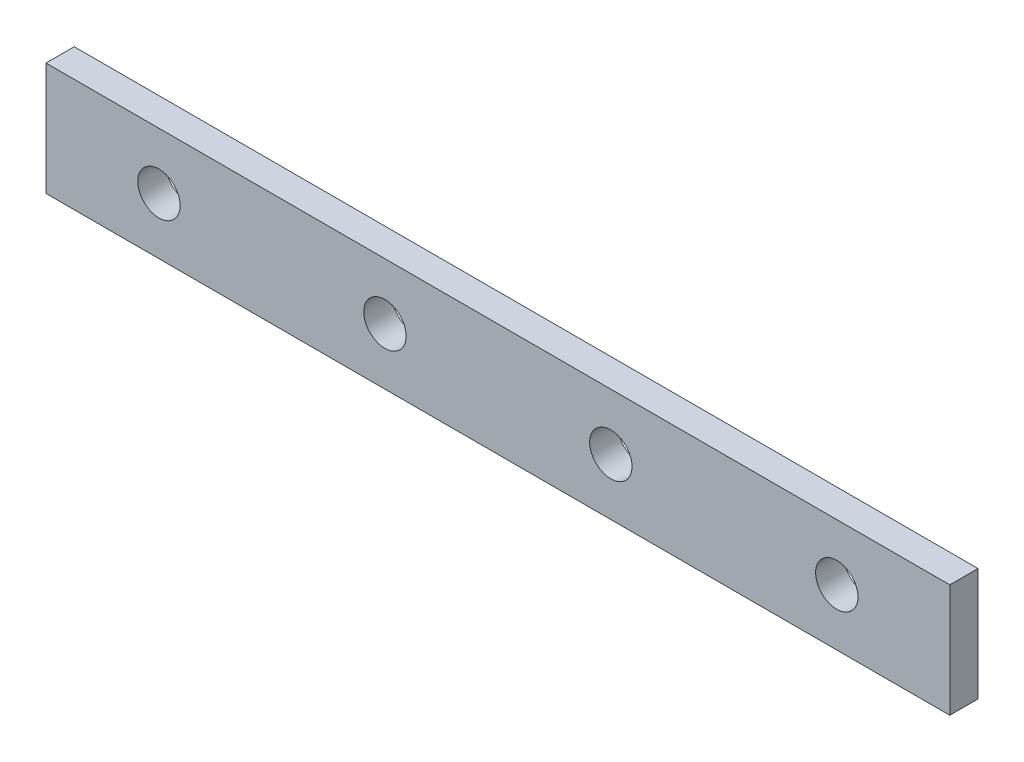
ISO-10303-21;
HEADER;
FILE_DESCRIPTION(('STEP AP214'),'2;1');
FILE_NAME('part.step','',(''),(''),'','','');
FILE_SCHEMA(('AUTOMOTIVE_DESIGN { 1 0 10303 214 1 1 1 1 }'));
ENDSEC;
DATA;
#1=APPLICATION_CONTEXT('core data for automotive mechanical design processes');
#2=APPLICATION_PROTOCOL_DEFINITION('international standard','automotive_design',2000,#1);
#3=PRODUCT_CONTEXT('',#1,'mechanical');
#4=PRODUCT('Part','Part','',(#3));
#5=PRODUCT_RELATED_PRODUCT_CATEGORY('part','',(#4));
#6=PRODUCT_DEFINITION_FORMATION('','',#4);
#7=PRODUCT_DEFINITION_CONTEXT('part definition',#1,'design');
#8=PRODUCT_DEFINITION('design','',#6,#7);
#9=PRODUCT_DEFINITION_SHAPE('','',#8);
#10=(LENGTH_UNIT() NAMED_UNIT(*) SI_UNIT(.MILLI.,.METRE.));
#11=(NAMED_UNIT(*) PLANE_ANGLE_UNIT() SI_UNIT($,.RADIAN.));
#12=(NAMED_UNIT(*) SI_UNIT($,.STERADIAN.) SOLID_ANGLE_UNIT());
#13=UNCERTAINTY_MEASURE_WITH_UNIT(LENGTH_MEASURE(1.E-05),#10,'distance_accuracy_value','');
#14=(GEOMETRIC_REPRESENTATION_CONTEXT(3) GLOBAL_UNCERTAINTY_ASSIGNED_CONTEXT((#13)) GLOBAL_UNIT_ASSIGNED_CONTEXT((#10,
#11,#12)) REPRESENTATION_CONTEXT('',''));
#15=CARTESIAN_POINT('',(0.,0.,0.));
#16=DIRECTION('',(0.,0.,1.));
#17=DIRECTION('',(1.,0.,0.));
#18=AXIS2_PLACEMENT_3D('',#15,#16,#17);
#19=CARTESIAN_POINT('',(76.2,0.,0.));
#20=DIRECTION('',(0.,0.,1.));
#21=DIRECTION('',(1.,0.,0.));
#22=AXIS2_PLACEMENT_3D('',#19,#20,#21);
#23=CYLINDRICAL_SURFACE('',#22,4.7625);
#24=CARTESIAN_POINT('',(76.2,0.,0.));
#25=DIRECTION('',(0.,0.,1.));
#26=DIRECTION('',(1.,0.,0.));
#27=AXIS2_PLACEMENT_3D('',#24,#25,#26);
#28=CIRCLE('',#27,4.7625);
#29=CARTESIAN_POINT('',(80.9625,0.,0.));
#30=VERTEX_POINT('',#29);
#31=EDGE_CURVE('E41',#30,#30,#28,.T.);
#32=ORIENTED_EDGE('',*,*,#31,.F.);
#33=EDGE_LOOP('',(#32));
#34=FACE_BOUND('',#33,.T.);
#35=CARTESIAN_POINT('',(76.2,0.,6.35));
#36=DIRECTION('',(0.,0.,1.));
#37=DIRECTION('',(1.,0.,0.));
#38=AXIS2_PLACEMENT_3D('',#35,#36,#37);
#39=CIRCLE('',#38,4.7625);
#40=CARTESIAN_POINT('',(80.9625,0.,6.35));
#41=VERTEX_POINT('',#40);
#42=EDGE_CURVE('E11',#41,#41,#39,.T.);
#43=ORIENTED_EDGE('',*,*,#42,.T.);
#44=EDGE_LOOP('',(#43));
#45=FACE_BOUND('',#44,.T.);
#46=ADVANCED_FACE('F33',(#34,#45),#23,.F.);
#47=CARTESIAN_POINT('',(25.4,0.,0.));
#48=DIRECTION('',(0.,0.,1.));
#49=DIRECTION('',(1.,0.,0.));
#50=AXIS2_PLACEMENT_3D('',#47,#48,#49);
#51=CYLINDRICAL_SURFACE('',#50,4.7625);
#52=CARTESIAN_POINT('',(25.4,0.,0.));
#53=DIRECTION('',(0.,0.,1.));
#54=DIRECTION('',(1.,0.,0.));
#55=AXIS2_PLACEMENT_3D('',#52,#53,#54);
#56=CIRCLE('',#55,4.7625);
#57=CARTESIAN_POINT('',(30.1625,0.,0.));
#58=VERTEX_POINT('',#57);
#59=EDGE_CURVE('E111',#58,#58,#56,.T.);
#60=ORIENTED_EDGE('',*,*,#59,.F.);
#61=EDGE_LOOP('',(#60));
#62=FACE_BOUND('',#61,.T.);
#63=CARTESIAN_POINT('',(25.4,0.,6.35));
#64=DIRECTION('',(0.,0.,1.));
#65=DIRECTION('',(1.,0.,0.));
#66=AXIS2_PLACEMENT_3D('',#63,#64,#65);
#67=CIRCLE('',#66,4.7625);
#68=CARTESIAN_POINT('',(30.1625,0.,6.35));
#69=VERTEX_POINT('',#68);
#70=EDGE_CURVE('E114',#69,#69,#67,.T.);
#71=ORIENTED_EDGE('',*,*,#70,.T.);
#72=EDGE_LOOP('',(#71));
#73=FACE_BOUND('',#72,.T.);
#74=ADVANCED_FACE('F123',(#62,#73),#51,.F.);
#75=CARTESIAN_POINT('',(-101.6,-12.7,6.35));
#76=DIRECTION('',(1.,0.,0.));
#77=DIRECTION('',(0.,0.,-1.));
#78=AXIS2_PLACEMENT_3D('',#75,#76,#77);
#79=PLANE('',#78);
#80=DIRECTION('',(0.,-1.,0.));
#81=VECTOR('',#80,1.);
#82=CARTESIAN_POINT('',(-101.6,-12.7,0.));
#83=LINE('',#82,#81);
#84=CARTESIAN_POINT('',(-101.6,12.7,0.));
#85=VERTEX_POINT('',#84);
#86=CARTESIAN_POINT('',(-101.6,-12.7,0.));
#87=VERTEX_POINT('',#86);
#88=EDGE_CURVE('E101',#85,#87,#83,.T.);
#89=ORIENTED_EDGE('',*,*,#88,.T.);
#90=DIRECTION('',(0.,0.,-1.));
#91=VECTOR('',#90,1.);
#92=CARTESIAN_POINT('',(-101.6,-12.7,6.35));
#93=LINE('',#92,#91);
#94=CARTESIAN_POINT('',(-101.6,-12.7,6.35));
#95=VERTEX_POINT('',#94);
#96=EDGE_CURVE('E92',#95,#87,#93,.T.);
#97=ORIENTED_EDGE('',*,*,#96,.F.);
#98=DIRECTION('',(0.,-1.,0.));
#99=VECTOR('',#98,1.);
#100=CARTESIAN_POINT('',(-101.6,-12.7,6.35));
#101=LINE('',#100,#99);
#102=CARTESIAN_POINT('',(-101.6,12.7,6.35));
#103=VERTEX_POINT('',#102);
#104=EDGE_CURVE('E86',#103,#95,#101,.T.);
#105=ORIENTED_EDGE('',*,*,#104,.F.);
#106=DIRECTION('',(0.,0.,-1.));
#107=VECTOR('',#106,1.);
#108=CARTESIAN_POINT('',(-101.6,12.7,6.35));
#109=LINE('',#108,#107);
#110=EDGE_CURVE('E97',#103,#85,#109,.T.);
#111=ORIENTED_EDGE('',*,*,#110,.T.);
#112=EDGE_LOOP('',(#89,#97,#105,#111));
#113=FACE_BOUND('',#112,.T.);
#114=ADVANCED_FACE('F147',(#113),#79,.F.);
#115=CARTESIAN_POINT('',(101.6,-12.7,6.35));
#116=DIRECTION('',(0.,1.,0.));
#117=DIRECTION('',(-1.,0.,0.));
#118=AXIS2_PLACEMENT_3D('',#115,#116,#117);
#119=PLANE('',#118);
#120=DIRECTION('',(1.,0.,0.));
#121=VECTOR('',#120,1.);
#122=CARTESIAN_POINT('',(101.6,-12.7,0.));
#123=LINE('',#122,#121);
#124=CARTESIAN_POINT('',(101.6,-12.7,0.));
#125=VERTEX_POINT('',#124);
#126=EDGE_CURVE('E91',#87,#125,#123,.T.);
#127=ORIENTED_EDGE('',*,*,#126,.T.);
#128=DIRECTION('',(0.,0.,-1.));
#129=VECTOR('',#128,1.);
#130=CARTESIAN_POINT('',(101.6,-12.7,6.35));
#131=LINE('',#130,#129);
#132=CARTESIAN_POINT('',(101.6,-12.7,6.35));
#133=VERTEX_POINT('',#132);
#134=EDGE_CURVE('E89',#133,#125,#131,.T.);
#135=ORIENTED_EDGE('',*,*,#134,.F.);
#136=DIRECTION('',(1.,0.,0.));
#137=VECTOR('',#136,1.);
#138=CARTESIAN_POINT('',(101.6,-12.7,6.35));
#139=LINE('',#138,#137);
#140=EDGE_CURVE('E80',#95,#133,#139,.T.);
#141=ORIENTED_EDGE('',*,*,#140,.F.);
#142=ORIENTED_EDGE('',*,*,#96,.T.);
#143=EDGE_LOOP('',(#127,#135,#141,#142));
#144=FACE_BOUND('',#143,.T.);
#145=ADVANCED_FACE('F90',(#144),#119,.F.);
#146=CARTESIAN_POINT('',(101.6,-12.7,6.35));
#147=DIRECTION('',(-1.,0.,0.));
#148=DIRECTION('',(0.,0.,1.));
#149=AXIS2_PLACEMENT_3D('',#146,#147,#148);
#150=PLANE('',#149);
#151=DIRECTION('',(0.,1.,0.));
#152=VECTOR('',#151,1.);
#153=CARTESIAN_POINT('',(101.6,-12.7,0.));
#154=LINE('',#153,#152);
#155=CARTESIAN_POINT('',(101.6,12.7,0.));
#156=VERTEX_POINT('',#155);
#157=EDGE_CURVE('E66',#125,#156,#154,.T.);
#158=ORIENTED_EDGE('',*,*,#157,.T.);
#159=DIRECTION('',(0.,0.,-1.));
#160=VECTOR('',#159,1.);
#161=CARTESIAN_POINT('',(101.6,12.7,6.35));
#162=LINE('',#161,#160);
#163=CARTESIAN_POINT('',(101.6,12.7,6.35));
#164=VERTEX_POINT('',#163);
#165=EDGE_CURVE('E93',#164,#156,#162,.T.);
#166=ORIENTED_EDGE('',*,*,#165,.F.);
#167=DIRECTION('',(0.,1.,0.));
#168=VECTOR('',#167,1.);
#169=CARTESIAN_POINT('',(101.6,-12.7,6.35));
#170=LINE('',#169,#168);
#171=EDGE_CURVE('E84',#133,#164,#170,.T.);
#172=ORIENTED_EDGE('',*,*,#171,.F.);
#173=ORIENTED_EDGE('',*,*,#134,.T.);
#174=EDGE_LOOP('',(#158,#166,#172,#173));
#175=FACE_BOUND('',#174,.T.);
#176=ADVANCED_FACE('F95',(#175),#150,.F.);
#177=CARTESIAN_POINT('',(101.6,12.7,6.35));
#178=DIRECTION('',(0.,-1.,0.));
#179=DIRECTION('',(1.,0.,0.));
#180=AXIS2_PLACEMENT_3D('',#177,#178,#179);
#181=PLANE('',#180);
#182=DIRECTION('',(-1.,0.,0.));
#183=VECTOR('',#182,1.);
#184=CARTESIAN_POINT('',(101.6,12.7,0.));
#185=LINE('',#184,#183);
#186=EDGE_CURVE('E72',#156,#85,#185,.T.);
#187=ORIENTED_EDGE('',*,*,#186,.T.);
#188=ORIENTED_EDGE('',*,*,#110,.F.);
#189=DIRECTION('',(-1.,0.,0.));
#190=VECTOR('',#189,1.);
#191=CARTESIAN_POINT('',(101.6,12.7,6.35));
#192=LINE('',#191,#190);
#193=EDGE_CURVE('E49',#164,#103,#192,.T.);
#194=ORIENTED_EDGE('',*,*,#193,.F.);
#195=ORIENTED_EDGE('',*,*,#165,.T.);
#196=EDGE_LOOP('',(#187,#188,#194,#195));
#197=FACE_BOUND('',#196,.T.);
#198=ADVANCED_FACE('F127',(#197),#181,.F.);
#199=CARTESIAN_POINT('',(0.,0.,6.35));
#200=DIRECTION('',(0.,0.,1.));
#201=DIRECTION('',(1.,0.,0.));
#202=AXIS2_PLACEMENT_3D('',#199,#200,#201);
#203=PLANE('',#202);
#204=CARTESIAN_POINT('',(-25.4,0.,6.35));
#205=DIRECTION('',(0.,0.,1.));
#206=DIRECTION('',(1.,0.,0.));
#207=AXIS2_PLACEMENT_3D('',#204,#205,#206);
#208=CIRCLE('',#207,4.7625);
#209=CARTESIAN_POINT('',(-20.6375,0.,6.35));
#210=VERTEX_POINT('',#209);
#211=EDGE_CURVE('E218',#210,#210,#208,.T.);
#212=ORIENTED_EDGE('',*,*,#211,.F.);
#213=EDGE_LOOP('',(#212));
#214=FACE_BOUND('',#213,.T.);
#215=CARTESIAN_POINT('',(-76.2,0.,6.35));
#216=DIRECTION('',(0.,0.,1.));
#217=DIRECTION('',(1.,0.,0.));
#218=AXIS2_PLACEMENT_3D('',#215,#216,#217);
#219=CIRCLE('',#218,4.7625);
#220=CARTESIAN_POINT('',(-71.4375,0.,6.35));
#221=VERTEX_POINT('',#220);
#222=EDGE_CURVE('E219',#221,#221,#219,.T.);
#223=ORIENTED_EDGE('',*,*,#222,.F.);
#224=EDGE_LOOP('',(#223));
#225=FACE_BOUND('',#224,.T.);
#226=ORIENTED_EDGE('',*,*,#104,.T.);
#227=ORIENTED_EDGE('',*,*,#140,.T.);
#228=ORIENTED_EDGE('',*,*,#171,.T.);
#229=ORIENTED_EDGE('',*,*,#193,.T.);
#230=EDGE_LOOP('',(#226,#227,#228,#229));
#231=FACE_BOUND('',#230,.T.);
#232=ORIENTED_EDGE('',*,*,#70,.F.);
#233=EDGE_LOOP('',(#232));
#234=FACE_BOUND('',#233,.T.);
#235=ORIENTED_EDGE('',*,*,#42,.F.);
#236=EDGE_LOOP('',(#235));
#237=FACE_BOUND('',#236,.T.);
#238=ADVANCED_FACE('F81',(#214,#225,#231,#234,#237),#203,.T.);
#239=CARTESIAN_POINT('',(0.,0.,0.));
#240=DIRECTION('',(0.,0.,1.));
#241=DIRECTION('',(1.,0.,0.));
#242=AXIS2_PLACEMENT_3D('',#239,#240,#241);
#243=PLANE('',#242);
#244=CARTESIAN_POINT('',(-25.4,0.,0.));
#245=DIRECTION('',(0.,0.,1.));
#246=DIRECTION('',(1.,0.,0.));
#247=AXIS2_PLACEMENT_3D('',#244,#245,#246);
#248=CIRCLE('',#247,4.7625);
#249=CARTESIAN_POINT('',(-20.6375,0.,0.));
#250=VERTEX_POINT('',#249);
#251=EDGE_CURVE('E216',#250,#250,#248,.T.);
#252=ORIENTED_EDGE('',*,*,#251,.T.);
#253=EDGE_LOOP('',(#252));
#254=FACE_BOUND('',#253,.T.);
#255=CARTESIAN_POINT('',(-76.2,0.,0.));
#256=DIRECTION('',(0.,0.,1.));
#257=DIRECTION('',(1.,0.,0.));
#258=AXIS2_PLACEMENT_3D('',#255,#256,#257);
#259=CIRCLE('',#258,4.7625);
#260=CARTESIAN_POINT('',(-71.4375,0.,0.));
#261=VERTEX_POINT('',#260);
#262=EDGE_CURVE('E104',#261,#261,#259,.T.);
#263=ORIENTED_EDGE('',*,*,#262,.T.);
#264=EDGE_LOOP('',(#263));
#265=FACE_BOUND('',#264,.T.);
#266=ORIENTED_EDGE('',*,*,#88,.F.);
#267=ORIENTED_EDGE('',*,*,#186,.F.);
#268=ORIENTED_EDGE('',*,*,#157,.F.);
#269=ORIENTED_EDGE('',*,*,#126,.F.);
#270=EDGE_LOOP('',(#266,#267,#268,#269));
#271=FACE_BOUND('',#270,.T.);
#272=ORIENTED_EDGE('',*,*,#59,.T.);
#273=EDGE_LOOP('',(#272));
#274=FACE_BOUND('',#273,.T.);
#275=ORIENTED_EDGE('',*,*,#31,.T.);
#276=EDGE_LOOP('',(#275));
#277=FACE_BOUND('',#276,.T.);
#278=ADVANCED_FACE('F119',(#254,#265,#271,#274,#277),#243,.F.);
#279=CARTESIAN_POINT('',(-76.2,0.,0.));
#280=DIRECTION('',(0.,0.,1.));
#281=DIRECTION('',(1.,0.,0.));
#282=AXIS2_PLACEMENT_3D('',#279,#280,#281);
#283=CYLINDRICAL_SURFACE('',#282,4.7625);
#284=ORIENTED_EDGE('',*,*,#262,.F.);
#285=EDGE_LOOP('',(#284));
#286=FACE_BOUND('',#285,.T.);
#287=ORIENTED_EDGE('',*,*,#222,.T.);
#288=EDGE_LOOP('',(#287));
#289=FACE_BOUND('',#288,.T.);
#290=ADVANCED_FACE('F134',(#286,#289),#283,.F.);
#291=CARTESIAN_POINT('',(-25.4,0.,0.));
#292=DIRECTION('',(0.,0.,1.));
#293=DIRECTION('',(1.,0.,0.));
#294=AXIS2_PLACEMENT_3D('',#291,#292,#293);
#295=CYLINDRICAL_SURFACE('',#294,4.7625);
#296=ORIENTED_EDGE('',*,*,#251,.F.);
#297=EDGE_LOOP('',(#296));
#298=FACE_BOUND('',#297,.T.);
#299=ORIENTED_EDGE('',*,*,#211,.T.);
#300=EDGE_LOOP('',(#299));
#301=FACE_BOUND('',#300,.T.);
#302=ADVANCED_FACE('F185',(#298,#301),#295,.F.);
#303=CLOSED_SHELL('',(#46,#74,#114,#145,#176,#198,#238,#278,#290,#302));
#304=MANIFOLD_SOLID_BREP('B2',#303);
#305=ADVANCED_BREP_SHAPE_REPRESENTATION('',(#18,#304),#14);
#306=SHAPE_DEFINITION_REPRESENTATION(#9,#305);
ENDSEC;
END-ISO-10303-21;
